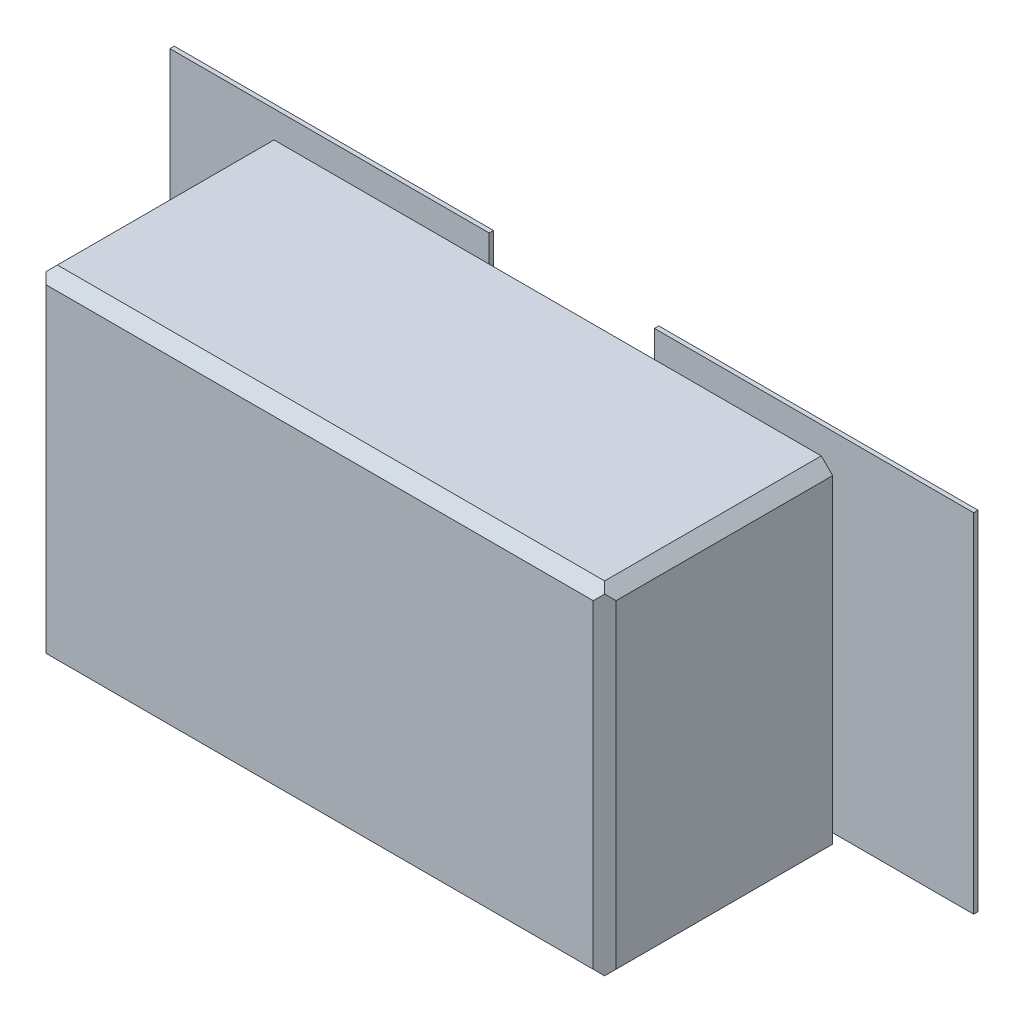
ISO-10303-21;
HEADER;
FILE_DESCRIPTION(('STEP AP214'),'2;1');
FILE_NAME('part.step','',(''),(''),'','','');
FILE_SCHEMA(('AUTOMOTIVE_DESIGN { 1 0 10303 214 1 1 1 1 }'));
ENDSEC;
DATA;
#1=APPLICATION_CONTEXT('core data for automotive mechanical design processes');
#2=APPLICATION_PROTOCOL_DEFINITION('international standard','automotive_design',2000,#1);
#3=PRODUCT_CONTEXT('',#1,'mechanical');
#4=PRODUCT('Part','Part','',(#3));
#5=PRODUCT_RELATED_PRODUCT_CATEGORY('part','',(#4));
#6=PRODUCT_DEFINITION_FORMATION('','',#4);
#7=PRODUCT_DEFINITION_CONTEXT('part definition',#1,'design');
#8=PRODUCT_DEFINITION('design','',#6,#7);
#9=PRODUCT_DEFINITION_SHAPE('','',#8);
#10=(LENGTH_UNIT() NAMED_UNIT(*) SI_UNIT(.MILLI.,.METRE.));
#11=(NAMED_UNIT(*) PLANE_ANGLE_UNIT() SI_UNIT($,.RADIAN.));
#12=(NAMED_UNIT(*) SI_UNIT($,.STERADIAN.) SOLID_ANGLE_UNIT());
#13=UNCERTAINTY_MEASURE_WITH_UNIT(LENGTH_MEASURE(1.E-05),#10,'distance_accuracy_value','');
#14=(GEOMETRIC_REPRESENTATION_CONTEXT(3) GLOBAL_UNCERTAINTY_ASSIGNED_CONTEXT((#13)) GLOBAL_UNIT_ASSIGNED_CONTEXT((#10,
#11,#12)) REPRESENTATION_CONTEXT('',''));
#15=CARTESIAN_POINT('',(0.,0.,0.));
#16=DIRECTION('',(0.,0.,1.));
#17=DIRECTION('',(1.,0.,0.));
#18=AXIS2_PLACEMENT_3D('',#15,#16,#17);
#19=CARTESIAN_POINT('',(-0.49,0.,0.5162));
#20=DIRECTION('',(-0.707106781186548,0.,0.707106781186548));
#21=DIRECTION('',(0.,1.,0.));
#22=AXIS2_PLACEMENT_3D('',#19,#20,#21);
#23=PLANE('',#22);
#24=DIRECTION('',(-0.577350269189626,0.577350269189626,-0.577350269189626));
#25=VECTOR('',#24,1.);
#26=CARTESIAN_POINT('',(-0.49,-0.29,0.5162));
#27=LINE('',#26,#25);
#28=CARTESIAN_POINT('',(-0.49,-0.29,0.5162));
#29=VERTEX_POINT('',#28);
#30=CARTESIAN_POINT('',(-0.5,-0.28,0.5062));
#31=VERTEX_POINT('',#30);
#32=EDGE_CURVE('P0_E207',#29,#31,#27,.T.);
#33=ORIENTED_EDGE('',*,*,#32,.F.);
#34=DIRECTION('',(-0.577350269189626,-0.577350269189626,-0.577350269189626));
#35=VECTOR('',#34,1.);
#36=CARTESIAN_POINT('',(-0.48,-0.28,0.5262));
#37=LINE('',#36,#35);
#38=CARTESIAN_POINT('',(-0.48,-0.28,0.5262));
#39=VERTEX_POINT('',#38);
#40=EDGE_CURVE('P0_E11',#39,#29,#37,.T.);
#41=ORIENTED_EDGE('',*,*,#40,.F.);
#42=DIRECTION('',(0.,-1.,0.));
#43=VECTOR('',#42,1.);
#44=CARTESIAN_POINT('',(-0.48,0.28,0.5262));
#45=LINE('',#44,#43);
#46=CARTESIAN_POINT('',(-0.48,0.28,0.5262));
#47=VERTEX_POINT('',#46);
#48=EDGE_CURVE('P0_E260',#47,#39,#45,.T.);
#49=ORIENTED_EDGE('',*,*,#48,.F.);
#50=DIRECTION('',(0.577350269189626,-0.577350269189626,0.577350269189626));
#51=VECTOR('',#50,1.);
#52=CARTESIAN_POINT('',(-0.49,0.29,0.5162));
#53=LINE('',#52,#51);
#54=CARTESIAN_POINT('',(-0.49,0.29,0.5162));
#55=VERTEX_POINT('',#54);
#56=EDGE_CURVE('P0_E261',#55,#47,#53,.T.);
#57=ORIENTED_EDGE('',*,*,#56,.F.);
#58=DIRECTION('',(0.577350269189626,0.577350269189626,0.577350269189626));
#59=VECTOR('',#58,1.);
#60=CARTESIAN_POINT('',(-0.5,0.28,0.5062));
#61=LINE('',#60,#59);
#62=CARTESIAN_POINT('',(-0.5,0.28,0.5062));
#63=VERTEX_POINT('',#62);
#64=EDGE_CURVE('P0_E210',#63,#55,#61,.T.);
#65=ORIENTED_EDGE('',*,*,#64,.F.);
#66=DIRECTION('',(0.,-1.,0.));
#67=VECTOR('',#66,1.);
#68=CARTESIAN_POINT('',(-0.5,0.28,0.5062));
#69=LINE('',#68,#67);
#70=EDGE_CURVE('P0_E204',#63,#31,#69,.T.);
#71=ORIENTED_EDGE('',*,*,#70,.T.);
#72=EDGE_LOOP('',(#33,#41,#49,#57,#65,#71));
#73=FACE_BOUND('',#72,.T.);
#74=ADVANCED_FACE('P0_F18',(#73),#23,.T.);
#75=CARTESIAN_POINT('',(0.,-0.29,0.5162));
#76=DIRECTION('',(0.,-0.707106781186548,0.707106781186548));
#77=DIRECTION('',(-1.,0.,0.));
#78=AXIS2_PLACEMENT_3D('',#75,#76,#77);
#79=PLANE('',#78);
#80=DIRECTION('',(-0.577350269189626,-0.577350269189626,-0.577350269189626));
#81=VECTOR('',#80,1.);
#82=CARTESIAN_POINT('',(0.49,-0.29,0.5162));
#83=LINE('',#82,#81);
#84=CARTESIAN_POINT('',(0.49,-0.29,0.5162));
#85=VERTEX_POINT('',#84);
#86=CARTESIAN_POINT('',(0.48,-0.3,0.5062));
#87=VERTEX_POINT('',#86);
#88=EDGE_CURVE('P0_E305',#85,#87,#83,.T.);
#89=ORIENTED_EDGE('',*,*,#88,.F.);
#90=DIRECTION('',(0.577350269189626,-0.577350269189626,-0.577350269189626));
#91=VECTOR('',#90,1.);
#92=CARTESIAN_POINT('',(0.48,-0.28,0.5262));
#93=LINE('',#92,#91);
#94=CARTESIAN_POINT('',(0.48,-0.28,0.5262));
#95=VERTEX_POINT('',#94);
#96=EDGE_CURVE('P0_E29',#95,#85,#93,.T.);
#97=ORIENTED_EDGE('',*,*,#96,.F.);
#98=DIRECTION('',(1.,0.,0.));
#99=VECTOR('',#98,1.);
#100=CARTESIAN_POINT('',(-0.48,-0.28,0.5262));
#101=LINE('',#100,#99);
#102=EDGE_CURVE('P0_E300',#39,#95,#101,.T.);
#103=ORIENTED_EDGE('',*,*,#102,.F.);
#104=ORIENTED_EDGE('',*,*,#40,.T.);
#105=DIRECTION('',(-0.577350269189626,0.577350269189626,0.577350269189626));
#106=VECTOR('',#105,1.);
#107=CARTESIAN_POINT('',(-0.48,-0.3,0.5062));
#108=LINE('',#107,#106);
#109=CARTESIAN_POINT('',(-0.48,-0.3,0.5062));
#110=VERTEX_POINT('',#109);
#111=EDGE_CURVE('P0_E227',#110,#29,#108,.T.);
#112=ORIENTED_EDGE('',*,*,#111,.F.);
#113=DIRECTION('',(1.,0.,0.));
#114=VECTOR('',#113,1.);
#115=CARTESIAN_POINT('',(-0.48,-0.3,0.5062));
#116=LINE('',#115,#114);
#117=EDGE_CURVE('P0_E315',#110,#87,#116,.T.);
#118=ORIENTED_EDGE('',*,*,#117,.T.);
#119=EDGE_LOOP('',(#89,#97,#103,#104,#112,#118));
#120=FACE_BOUND('',#119,.T.);
#121=ADVANCED_FACE('P0_F568',(#120),#79,.T.);
#122=CARTESIAN_POINT('',(0.49,0.,0.5162));
#123=DIRECTION('',(0.707106781186548,0.,0.707106781186548));
#124=DIRECTION('',(0.,-1.,0.));
#125=AXIS2_PLACEMENT_3D('',#122,#123,#124);
#126=PLANE('',#125);
#127=DIRECTION('',(0.577350269189626,-0.577350269189626,-0.577350269189626));
#128=VECTOR('',#127,1.);
#129=CARTESIAN_POINT('',(0.49,0.29,0.5162));
#130=LINE('',#129,#128);
#131=CARTESIAN_POINT('',(0.49,0.29,0.5162));
#132=VERTEX_POINT('',#131);
#133=CARTESIAN_POINT('',(0.5,0.28,0.5062));
#134=VERTEX_POINT('',#133);
#135=EDGE_CURVE('P0_E286',#132,#134,#130,.T.);
#136=ORIENTED_EDGE('',*,*,#135,.F.);
#137=DIRECTION('',(0.577350269189626,0.577350269189626,-0.577350269189626));
#138=VECTOR('',#137,1.);
#139=CARTESIAN_POINT('',(0.48,0.28,0.5262));
#140=LINE('',#139,#138);
#141=CARTESIAN_POINT('',(0.48,0.28,0.5262));
#142=VERTEX_POINT('',#141);
#143=EDGE_CURVE('P0_E281',#142,#132,#140,.T.);
#144=ORIENTED_EDGE('',*,*,#143,.F.);
#145=DIRECTION('',(0.,1.,0.));
#146=VECTOR('',#145,1.);
#147=CARTESIAN_POINT('',(0.48,-0.28,0.5262));
#148=LINE('',#147,#146);
#149=EDGE_CURVE('P0_E297',#95,#142,#148,.T.);
#150=ORIENTED_EDGE('',*,*,#149,.F.);
#151=ORIENTED_EDGE('',*,*,#96,.T.);
#152=DIRECTION('',(-0.577350269189626,-0.577350269189626,0.577350269189626));
#153=VECTOR('',#152,1.);
#154=CARTESIAN_POINT('',(0.5,-0.28,0.5062));
#155=LINE('',#154,#153);
#156=CARTESIAN_POINT('',(0.5,-0.28,0.5062));
#157=VERTEX_POINT('',#156);
#158=EDGE_CURVE('P0_E301',#157,#85,#155,.T.);
#159=ORIENTED_EDGE('',*,*,#158,.F.);
#160=DIRECTION('',(0.,1.,0.));
#161=VECTOR('',#160,1.);
#162=CARTESIAN_POINT('',(0.5,-0.28,0.5062));
#163=LINE('',#162,#161);
#164=EDGE_CURVE('P0_E355',#157,#134,#163,.T.);
#165=ORIENTED_EDGE('',*,*,#164,.T.);
#166=EDGE_LOOP('',(#136,#144,#150,#151,#159,#165));
#167=FACE_BOUND('',#166,.T.);
#168=ADVANCED_FACE('P0_F574',(#167),#126,.T.);
#169=CARTESIAN_POINT('',(0.,0.,0.5262));
#170=DIRECTION('',(0.,0.,1.));
#171=DIRECTION('',(1.,0.,0.));
#172=AXIS2_PLACEMENT_3D('',#169,#170,#171);
#173=PLANE('',#172);
#174=DIRECTION('',(-1.,0.,0.));
#175=VECTOR('',#174,1.);
#176=CARTESIAN_POINT('',(0.48,0.28,0.5262));
#177=LINE('',#176,#175);
#178=EDGE_CURVE('P0_E256',#142,#47,#177,.T.);
#179=ORIENTED_EDGE('',*,*,#178,.T.);
#180=ORIENTED_EDGE('',*,*,#48,.T.);
#181=ORIENTED_EDGE('',*,*,#102,.T.);
#182=ORIENTED_EDGE('',*,*,#149,.T.);
#183=EDGE_LOOP('',(#179,#180,#181,#182));
#184=FACE_BOUND('',#183,.T.);
#185=ADVANCED_FACE('P0_F584',(#184),#173,.T.);
#186=CARTESIAN_POINT('',(0.,0.29,0.5162));
#187=DIRECTION('',(0.,0.707106781186548,0.707106781186548));
#188=DIRECTION('',(1.,0.,0.));
#189=AXIS2_PLACEMENT_3D('',#186,#187,#188);
#190=PLANE('',#189);
#191=ORIENTED_EDGE('',*,*,#143,.T.);
#192=DIRECTION('',(0.577350269189626,-0.577350269189626,0.577350269189626));
#193=VECTOR('',#192,1.);
#194=CARTESIAN_POINT('',(0.48,0.3,0.5062));
#195=LINE('',#194,#193);
#196=CARTESIAN_POINT('',(0.48,0.3,0.5062));
#197=VERTEX_POINT('',#196);
#198=EDGE_CURVE('P0_E254',#197,#132,#195,.T.);
#199=ORIENTED_EDGE('',*,*,#198,.F.);
#200=DIRECTION('',(-1.,0.,0.));
#201=VECTOR('',#200,1.);
#202=CARTESIAN_POINT('',(0.48,0.3,0.5062));
#203=LINE('',#202,#201);
#204=CARTESIAN_POINT('',(-0.48,0.3,0.5062));
#205=VERTEX_POINT('',#204);
#206=EDGE_CURVE('P0_E278',#197,#205,#203,.T.);
#207=ORIENTED_EDGE('',*,*,#206,.T.);
#208=DIRECTION('',(-0.577350269189626,-0.577350269189626,0.577350269189626));
#209=VECTOR('',#208,1.);
#210=CARTESIAN_POINT('',(-0.48,0.3,0.5062));
#211=LINE('',#210,#209);
#212=EDGE_CURVE('P0_E372',#205,#55,#211,.T.);
#213=ORIENTED_EDGE('',*,*,#212,.T.);
#214=ORIENTED_EDGE('',*,*,#56,.T.);
#215=ORIENTED_EDGE('',*,*,#178,.F.);
#216=EDGE_LOOP('',(#191,#199,#207,#213,#214,#215));
#217=FACE_BOUND('',#216,.T.);
#218=ADVANCED_FACE('P0_F580',(#217),#190,.T.);
#219=CARTESIAN_POINT('',(0.5,0.3,0.0762));
#220=DIRECTION('',(0.,1.,0.));
#221=DIRECTION('',(1.,0.,0.));
#222=AXIS2_PLACEMENT_3D('',#219,#220,#221);
#223=PLANE('',#222);
#224=DIRECTION('',(-1.,0.,0.));
#225=VECTOR('',#224,1.);
#226=CARTESIAN_POINT('',(0.48,0.3,0.1262));
#227=LINE('',#226,#225);
#228=CARTESIAN_POINT('',(0.48,0.3,0.1262));
#229=VERTEX_POINT('',#228);
#230=CARTESIAN_POINT('',(-0.48,0.3,0.1262));
#231=VERTEX_POINT('',#230);
#232=EDGE_CURVE('P0_E330',#229,#231,#227,.T.);
#233=ORIENTED_EDGE('',*,*,#232,.T.);
#234=DIRECTION('',(0.,0.,-1.));
#235=VECTOR('',#234,1.);
#236=CARTESIAN_POINT('',(-0.48,0.3,0.5062));
#237=LINE('',#236,#235);
#238=EDGE_CURVE('P0_E282',#205,#231,#237,.T.);
#239=ORIENTED_EDGE('',*,*,#238,.F.);
#240=ORIENTED_EDGE('',*,*,#206,.F.);
#241=DIRECTION('',(0.,0.,-1.));
#242=VECTOR('',#241,1.);
#243=CARTESIAN_POINT('',(0.48,0.3,0.5062));
#244=LINE('',#243,#242);
#245=EDGE_CURVE('P0_E251',#197,#229,#244,.T.);
#246=ORIENTED_EDGE('',*,*,#245,.T.);
#247=EDGE_LOOP('',(#233,#239,#240,#246));
#248=FACE_BOUND('',#247,.T.);
#249=ADVANCED_FACE('P0_F583',(#248),#223,.T.);
#250=CARTESIAN_POINT('',(-0.49,0.29,0.3262));
#251=DIRECTION('',(-0.707106781186548,0.707106781186548,0.));
#252=DIRECTION('',(0.,0.,1.));
#253=AXIS2_PLACEMENT_3D('',#250,#251,#252);
#254=PLANE('',#253);
#255=DIRECTION('',(0.,0.,-1.));
#256=VECTOR('',#255,1.);
#257=CARTESIAN_POINT('',(-0.5,0.28,0.5062));
#258=LINE('',#257,#256);
#259=CARTESIAN_POINT('',(-0.5,0.28,0.1262));
#260=VERTEX_POINT('',#259);
#261=EDGE_CURVE('P0_E214',#63,#260,#258,.T.);
#262=ORIENTED_EDGE('',*,*,#261,.F.);
#263=ORIENTED_EDGE('',*,*,#64,.T.);
#264=ORIENTED_EDGE('',*,*,#212,.F.);
#265=ORIENTED_EDGE('',*,*,#238,.T.);
#266=DIRECTION('',(0.707106781186548,0.707106781186548,0.));
#267=VECTOR('',#266,1.);
#268=CARTESIAN_POINT('',(-0.5,0.28,0.1262));
#269=LINE('',#268,#267);
#270=EDGE_CURVE('P0_E340',#260,#231,#269,.T.);
#271=ORIENTED_EDGE('',*,*,#270,.F.);
#272=EDGE_LOOP('',(#262,#263,#264,#265,#271));
#273=FACE_BOUND('',#272,.T.);
#274=ADVANCED_FACE('P0_F588',(#273),#254,.T.);
#275=CARTESIAN_POINT('',(-0.5,0.3,0.0762));
#276=DIRECTION('',(-1.,0.,0.));
#277=DIRECTION('',(0.,0.,1.));
#278=AXIS2_PLACEMENT_3D('',#275,#276,#277);
#279=PLANE('',#278);
#280=ORIENTED_EDGE('',*,*,#70,.F.);
#281=ORIENTED_EDGE('',*,*,#261,.T.);
#282=DIRECTION('',(0.,-1.,0.));
#283=VECTOR('',#282,1.);
#284=CARTESIAN_POINT('',(-0.5,0.28,0.1262));
#285=LINE('',#284,#283);
#286=CARTESIAN_POINT('',(-0.5,-0.28,0.1262));
#287=VERTEX_POINT('',#286);
#288=EDGE_CURVE('P0_E219',#260,#287,#285,.T.);
#289=ORIENTED_EDGE('',*,*,#288,.T.);
#290=DIRECTION('',(0.,0.,-1.));
#291=VECTOR('',#290,1.);
#292=CARTESIAN_POINT('',(-0.5,-0.28,0.5062));
#293=LINE('',#292,#291);
#294=EDGE_CURVE('P0_E215',#31,#287,#293,.T.);
#295=ORIENTED_EDGE('',*,*,#294,.F.);
#296=EDGE_LOOP('',(#280,#281,#289,#295));
#297=FACE_BOUND('',#296,.T.);
#298=ADVANCED_FACE('P0_F217',(#297),#279,.T.);
#299=CARTESIAN_POINT('',(-0.49,-0.29,0.3262));
#300=DIRECTION('',(-0.707106781186548,-0.707106781186548,0.));
#301=DIRECTION('',(-0.707106781186548,0.707106781186548,0.));
#302=AXIS2_PLACEMENT_3D('',#299,#300,#301);
#303=PLANE('',#302);
#304=DIRECTION('',(0.,0.,-1.));
#305=VECTOR('',#304,1.);
#306=CARTESIAN_POINT('',(-0.48,-0.3,0.5062));
#307=LINE('',#306,#305);
#308=CARTESIAN_POINT('',(-0.48,-0.3,0.1262));
#309=VERTEX_POINT('',#308);
#310=EDGE_CURVE('P0_E236',#110,#309,#307,.T.);
#311=ORIENTED_EDGE('',*,*,#310,.F.);
#312=ORIENTED_EDGE('',*,*,#111,.T.);
#313=ORIENTED_EDGE('',*,*,#32,.T.);
#314=ORIENTED_EDGE('',*,*,#294,.T.);
#315=DIRECTION('',(-0.707106781186548,0.707106781186548,0.));
#316=VECTOR('',#315,1.);
#317=CARTESIAN_POINT('',(-0.48,-0.3,0.1262));
#318=LINE('',#317,#316);
#319=EDGE_CURVE('P0_E287',#309,#287,#318,.T.);
#320=ORIENTED_EDGE('',*,*,#319,.F.);
#321=EDGE_LOOP('',(#311,#312,#313,#314,#320));
#322=FACE_BOUND('',#321,.T.);
#323=ADVANCED_FACE('P0_F226',(#322),#303,.T.);
#324=CARTESIAN_POINT('',(-0.5,-0.3,0.0762));
#325=DIRECTION('',(0.,-1.,0.));
#326=DIRECTION('',(0.,0.,-1.));
#327=AXIS2_PLACEMENT_3D('',#324,#325,#326);
#328=PLANE('',#327);
#329=ORIENTED_EDGE('',*,*,#117,.F.);
#330=ORIENTED_EDGE('',*,*,#310,.T.);
#331=DIRECTION('',(1.,0.,0.));
#332=VECTOR('',#331,1.);
#333=CARTESIAN_POINT('',(-0.48,-0.3,0.1262));
#334=LINE('',#333,#332);
#335=CARTESIAN_POINT('',(0.48,-0.3,0.1262));
#336=VERTEX_POINT('',#335);
#337=EDGE_CURVE('P0_E290',#309,#336,#334,.T.);
#338=ORIENTED_EDGE('',*,*,#337,.T.);
#339=DIRECTION('',(0.,0.,-1.));
#340=VECTOR('',#339,1.);
#341=CARTESIAN_POINT('',(0.48,-0.3,0.5062));
#342=LINE('',#341,#340);
#343=EDGE_CURVE('P0_E312',#87,#336,#342,.T.);
#344=ORIENTED_EDGE('',*,*,#343,.F.);
#345=EDGE_LOOP('',(#329,#330,#338,#344));
#346=FACE_BOUND('',#345,.T.);
#347=ADVANCED_FACE('P0_F589',(#346),#328,.T.);
#348=CARTESIAN_POINT('',(0.49,-0.29,0.3262));
#349=DIRECTION('',(0.707106781186548,-0.707106781186548,0.));
#350=DIRECTION('',(0.,0.,-1.));
#351=AXIS2_PLACEMENT_3D('',#348,#349,#350);
#352=PLANE('',#351);
#353=DIRECTION('',(0.,0.,-1.));
#354=VECTOR('',#353,1.);
#355=CARTESIAN_POINT('',(0.5,-0.28,0.5062));
#356=LINE('',#355,#354);
#357=CARTESIAN_POINT('',(0.5,-0.28,0.1262));
#358=VERTEX_POINT('',#357);
#359=EDGE_CURVE('P0_E306',#157,#358,#356,.T.);
#360=ORIENTED_EDGE('',*,*,#359,.F.);
#361=ORIENTED_EDGE('',*,*,#158,.T.);
#362=ORIENTED_EDGE('',*,*,#88,.T.);
#363=ORIENTED_EDGE('',*,*,#343,.T.);
#364=DIRECTION('',(-0.707106781186548,-0.707106781186548,0.));
#365=VECTOR('',#364,1.);
#366=CARTESIAN_POINT('',(0.5,-0.28,0.1262));
#367=LINE('',#366,#365);
#368=EDGE_CURVE('P0_E363',#358,#336,#367,.T.);
#369=ORIENTED_EDGE('',*,*,#368,.F.);
#370=EDGE_LOOP('',(#360,#361,#362,#363,#369));
#371=FACE_BOUND('',#370,.T.);
#372=ADVANCED_FACE('P0_F578',(#371),#352,.T.);
#373=CARTESIAN_POINT('',(0.5,-0.3,0.0762));
#374=DIRECTION('',(1.,0.,0.));
#375=DIRECTION('',(0.,1.,0.));
#376=AXIS2_PLACEMENT_3D('',#373,#374,#375);
#377=PLANE('',#376);
#378=ORIENTED_EDGE('',*,*,#164,.F.);
#379=ORIENTED_EDGE('',*,*,#359,.T.);
#380=DIRECTION('',(0.,1.,0.));
#381=VECTOR('',#380,1.);
#382=CARTESIAN_POINT('',(0.5,-0.28,0.1262));
#383=LINE('',#382,#381);
#384=CARTESIAN_POINT('',(0.5,0.28,0.1262));
#385=VERTEX_POINT('',#384);
#386=EDGE_CURVE('P0_E380',#358,#385,#383,.T.);
#387=ORIENTED_EDGE('',*,*,#386,.T.);
#388=DIRECTION('',(0.,0.,-1.));
#389=VECTOR('',#388,1.);
#390=CARTESIAN_POINT('',(0.5,0.28,0.5062));
#391=LINE('',#390,#389);
#392=EDGE_CURVE('P0_E368',#134,#385,#391,.T.);
#393=ORIENTED_EDGE('',*,*,#392,.F.);
#394=EDGE_LOOP('',(#378,#379,#387,#393));
#395=FACE_BOUND('',#394,.T.);
#396=ADVANCED_FACE('P0_F626',(#395),#377,.T.);
#397=CARTESIAN_POINT('',(0.49,0.29,0.3262));
#398=DIRECTION('',(0.707106781186548,0.707106781186548,0.));
#399=DIRECTION('',(0.,0.,-1.));
#400=AXIS2_PLACEMENT_3D('',#397,#398,#399);
#401=PLANE('',#400);
#402=ORIENTED_EDGE('',*,*,#245,.F.);
#403=ORIENTED_EDGE('',*,*,#198,.T.);
#404=ORIENTED_EDGE('',*,*,#135,.T.);
#405=ORIENTED_EDGE('',*,*,#392,.T.);
#406=DIRECTION('',(0.707106781186548,-0.707106781186548,0.));
#407=VECTOR('',#406,1.);
#408=CARTESIAN_POINT('',(0.48,0.3,0.1262));
#409=LINE('',#408,#407);
#410=EDGE_CURVE('P0_E267',#229,#385,#409,.T.);
#411=ORIENTED_EDGE('',*,*,#410,.F.);
#412=EDGE_LOOP('',(#402,#403,#404,#405,#411));
#413=FACE_BOUND('',#412,.T.);
#414=ADVANCED_FACE('P0_F610',(#413),#401,.T.);
#415=CARTESIAN_POINT('',(-0.4659973957868,-0.25,0.1262));
#416=DIRECTION('',(-1.,0.,0.));
#417=DIRECTION('',(0.,0.,1.));
#418=AXIS2_PLACEMENT_3D('',#415,#416,#417);
#419=PLANE('',#418);
#420=DIRECTION('',(0.,0.,-1.));
#421=VECTOR('',#420,1.);
#422=CARTESIAN_POINT('',(-0.4659973957868,0.2,0.1262));
#423=LINE('',#422,#421);
#424=CARTESIAN_POINT('',(-0.4659973957868,0.2,0.1262));
#425=VERTEX_POINT('',#424);
#426=CARTESIAN_POINT('',(-0.4659973957868,0.2,0.0862));
#427=VERTEX_POINT('',#426);
#428=EDGE_CURVE('P0_E255',#425,#427,#423,.T.);
#429=ORIENTED_EDGE('',*,*,#428,.T.);
#430=DIRECTION('',(0.,1.,0.));
#431=VECTOR('',#430,1.);
#432=CARTESIAN_POINT('',(-0.4659973957868,-0.25,0.0862));
#433=LINE('',#432,#431);
#434=CARTESIAN_POINT('',(-0.4659973957868,-0.25,0.0862));
#435=VERTEX_POINT('',#434);
#436=EDGE_CURVE('P0_E399',#435,#427,#433,.T.);
#437=ORIENTED_EDGE('',*,*,#436,.F.);
#438=DIRECTION('',(0.,0.,-1.));
#439=VECTOR('',#438,1.);
#440=CARTESIAN_POINT('',(-0.4659973957868,-0.25,0.1262));
#441=LINE('',#440,#439);
#442=CARTESIAN_POINT('',(-0.4659973957868,-0.25,0.1262));
#443=VERTEX_POINT('',#442);
#444=EDGE_CURVE('P0_E307',#443,#435,#441,.T.);
#445=ORIENTED_EDGE('',*,*,#444,.F.);
#446=DIRECTION('',(0.,1.,0.));
#447=VECTOR('',#446,1.);
#448=CARTESIAN_POINT('',(-0.4659973957868,-0.25,0.1262));
#449=LINE('',#448,#447);
#450=EDGE_CURVE('P0_E22',#443,#425,#449,.T.);
#451=ORIENTED_EDGE('',*,*,#450,.T.);
#452=EDGE_LOOP('',(#429,#437,#445,#451));
#453=FACE_BOUND('',#452,.T.);
#454=ADVANCED_FACE('P0_F486',(#453),#419,.T.);
#455=CARTESIAN_POINT('',(-0.4659973957868,0.25,0.1262));
#456=DIRECTION('',(0.,0.,-1.));
#457=DIRECTION('',(-1.,0.,0.));
#458=AXIS2_PLACEMENT_3D('',#455,#456,#457);
#459=CYLINDRICAL_SURFACE('',#458,0.05);
#460=DIRECTION('',(0.,0.,-1.));
#461=VECTOR('',#460,1.);
#462=CARTESIAN_POINT('',(-0.4159973957868,0.25,0.1262));
#463=LINE('',#462,#461);
#464=CARTESIAN_POINT('',(-0.4159973957868,0.25,0.1262));
#465=VERTEX_POINT('',#464);
#466=CARTESIAN_POINT('',(-0.4159973957868,0.25,0.0862));
#467=VERTEX_POINT('',#466);
#468=EDGE_CURVE('P0_E249',#465,#467,#463,.T.);
#469=ORIENTED_EDGE('',*,*,#468,.T.);
#470=CARTESIAN_POINT('',(-0.4659973957868,0.25,0.0862));
#471=DIRECTION('',(0.,0.,1.));
#472=DIRECTION('',(0.,-1.,0.));
#473=AXIS2_PLACEMENT_3D('',#470,#471,#472);
#474=CIRCLE('',#473,0.05);
#475=EDGE_CURVE('P0_E277',#427,#467,#474,.T.);
#476=ORIENTED_EDGE('',*,*,#475,.F.);
#477=ORIENTED_EDGE('',*,*,#428,.F.);
#478=CARTESIAN_POINT('',(-0.4659973957868,0.25,0.1262));
#479=DIRECTION('',(0.,0.,-1.));
#480=DIRECTION('',(1.,0.,0.));
#481=AXIS2_PLACEMENT_3D('',#478,#479,#480);
#482=CIRCLE('',#481,0.05);
#483=EDGE_CURVE('P0_E266',#465,#425,#482,.T.);
#484=ORIENTED_EDGE('',*,*,#483,.F.);
#485=EDGE_LOOP('',(#469,#476,#477,#484));
#486=FACE_BOUND('',#485,.T.);
#487=ADVANCED_FACE('P0_F475',(#486),#459,.F.);
#488=CARTESIAN_POINT('',(-0.4159973957868,0.25,0.1262));
#489=DIRECTION('',(0.,1.,0.));
#490=DIRECTION('',(1.,0.,0.));
#491=AXIS2_PLACEMENT_3D('',#488,#489,#490);
#492=PLANE('',#491);
#493=DIRECTION('',(0.,0.,-1.));
#494=VECTOR('',#493,1.);
#495=CARTESIAN_POINT('',(-0.2159973957868,0.25,0.1262));
#496=LINE('',#495,#494);
#497=CARTESIAN_POINT('',(-0.2159973957868,0.25,0.1262));
#498=VERTEX_POINT('',#497);
#499=CARTESIAN_POINT('',(-0.2159973957868,0.25,0.0862));
#500=VERTEX_POINT('',#499);
#501=EDGE_CURVE('P0_E246',#498,#500,#496,.T.);
#502=ORIENTED_EDGE('',*,*,#501,.T.);
#503=DIRECTION('',(1.,0.,0.));
#504=VECTOR('',#503,1.);
#505=CARTESIAN_POINT('',(-0.4159973957868,0.25,0.0862));
#506=LINE('',#505,#504);
#507=EDGE_CURVE('P0_E273',#467,#500,#506,.T.);
#508=ORIENTED_EDGE('',*,*,#507,.F.);
#509=ORIENTED_EDGE('',*,*,#468,.F.);
#510=DIRECTION('',(1.,0.,0.));
#511=VECTOR('',#510,1.);
#512=CARTESIAN_POINT('',(-0.4159973957868,0.25,0.1262));
#513=LINE('',#512,#511);
#514=EDGE_CURVE('P0_E262',#465,#498,#513,.T.);
#515=ORIENTED_EDGE('',*,*,#514,.T.);
#516=EDGE_LOOP('',(#502,#508,#509,#515));
#517=FACE_BOUND('',#516,.T.);
#518=ADVANCED_FACE('P0_F478',(#517),#492,.T.);
#519=CARTESIAN_POINT('',(-0.2159973957868,0.25,0.1262));
#520=DIRECTION('',(1.,0.,0.));
#521=DIRECTION('',(0.,1.,0.));
#522=AXIS2_PLACEMENT_3D('',#519,#520,#521);
#523=PLANE('',#522);
#524=DIRECTION('',(0.,0.,-1.));
#525=VECTOR('',#524,1.);
#526=CARTESIAN_POINT('',(-0.2159973957868,-0.25,0.1262));
#527=LINE('',#526,#525);
#528=CARTESIAN_POINT('',(-0.2159973957868,-0.25,0.1262));
#529=VERTEX_POINT('',#528);
#530=CARTESIAN_POINT('',(-0.2159973957868,-0.25,0.0862));
#531=VERTEX_POINT('',#530);
#532=EDGE_CURVE('P0_E381',#529,#531,#527,.T.);
#533=ORIENTED_EDGE('',*,*,#532,.T.);
#534=DIRECTION('',(0.,-1.,0.));
#535=VECTOR('',#534,1.);
#536=CARTESIAN_POINT('',(-0.2159973957868,0.25,0.0862));
#537=LINE('',#536,#535);
#538=EDGE_CURVE('P0_E250',#500,#531,#537,.T.);
#539=ORIENTED_EDGE('',*,*,#538,.F.);
#540=ORIENTED_EDGE('',*,*,#501,.F.);
#541=DIRECTION('',(0.,-1.,0.));
#542=VECTOR('',#541,1.);
#543=CARTESIAN_POINT('',(-0.2159973957868,0.25,0.1262));
#544=LINE('',#543,#542);
#545=EDGE_CURVE('P0_E323',#498,#529,#544,.T.);
#546=ORIENTED_EDGE('',*,*,#545,.T.);
#547=EDGE_LOOP('',(#533,#539,#540,#546));
#548=FACE_BOUND('',#547,.T.);
#549=ADVANCED_FACE('P0_F558',(#548),#523,.T.);
#550=CARTESIAN_POINT('',(0.,0.,0.0862));
#551=DIRECTION('',(0.,0.,-1.));
#552=DIRECTION('',(0.,-1.,0.));
#553=AXIS2_PLACEMENT_3D('',#550,#551,#552);
#554=PLANE('',#553);
#555=DIRECTION('',(-1.,0.,0.));
#556=VECTOR('',#555,1.);
#557=CARTESIAN_POINT('',(-0.2159973957868,-0.25,0.0862));
#558=LINE('',#557,#556);
#559=EDGE_CURVE('P0_E311',#531,#435,#558,.T.);
#560=ORIENTED_EDGE('',*,*,#559,.T.);
#561=ORIENTED_EDGE('',*,*,#436,.T.);
#562=ORIENTED_EDGE('',*,*,#475,.T.);
#563=ORIENTED_EDGE('',*,*,#507,.T.);
#564=ORIENTED_EDGE('',*,*,#538,.T.);
#565=EDGE_LOOP('',(#560,#561,#562,#563,#564));
#566=FACE_BOUND('',#565,.T.);
#567=ADVANCED_FACE('P0_F481',(#566),#554,.T.);
#568=CARTESIAN_POINT('',(0.,0.,0.0862));
#569=DIRECTION('',(0.,0.,-1.));
#570=DIRECTION('',(0.,-1.,0.));
#571=AXIS2_PLACEMENT_3D('',#568,#569,#570);
#572=PLANE('',#571);
#573=DIRECTION('',(-1.,0.,0.));
#574=VECTOR('',#573,1.);
#575=CARTESIAN_POINT('',(0.4340026042132,-0.25,0.0862));
#576=LINE('',#575,#574);
#577=CARTESIAN_POINT('',(0.4340026042132,-0.25,0.0862));
#578=VERTEX_POINT('',#577);
#579=CARTESIAN_POINT('',(0.1840026042132,-0.25,0.0862));
#580=VERTEX_POINT('',#579);
#581=EDGE_CURVE('P0_E396',#578,#580,#576,.T.);
#582=ORIENTED_EDGE('',*,*,#581,.T.);
#583=DIRECTION('',(0.,1.,0.));
#584=VECTOR('',#583,1.);
#585=CARTESIAN_POINT('',(0.1840026042132,-0.25,0.0862));
#586=LINE('',#585,#584);
#587=CARTESIAN_POINT('',(0.1840026042132,0.25,0.0862));
#588=VERTEX_POINT('',#587);
#589=EDGE_CURVE('P0_E322',#580,#588,#586,.T.);
#590=ORIENTED_EDGE('',*,*,#589,.T.);
#591=DIRECTION('',(1.,0.,0.));
#592=VECTOR('',#591,1.);
#593=CARTESIAN_POINT('',(0.1840026042132,0.25,0.0862));
#594=LINE('',#593,#592);
#595=CARTESIAN_POINT('',(0.4340026042132,0.25,0.0862));
#596=VERTEX_POINT('',#595);
#597=EDGE_CURVE('P0_E272',#588,#596,#594,.T.);
#598=ORIENTED_EDGE('',*,*,#597,.T.);
#599=DIRECTION('',(0.,-1.,0.));
#600=VECTOR('',#599,1.);
#601=CARTESIAN_POINT('',(0.4340026042132,0.25,0.0862));
#602=LINE('',#601,#600);
#603=EDGE_CURVE('P0_E240',#596,#578,#602,.T.);
#604=ORIENTED_EDGE('',*,*,#603,.T.);
#605=EDGE_LOOP('',(#582,#590,#598,#604));
#606=FACE_BOUND('',#605,.T.);
#607=ADVANCED_FACE('P0_F455',(#606),#572,.T.);
#608=CARTESIAN_POINT('',(0.4340026042132,-0.25,0.1262));
#609=DIRECTION('',(0.,-1.,0.));
#610=DIRECTION('',(0.,0.,-1.));
#611=AXIS2_PLACEMENT_3D('',#608,#609,#610);
#612=PLANE('',#611);
#613=DIRECTION('',(0.,0.,-1.));
#614=VECTOR('',#613,1.);
#615=CARTESIAN_POINT('',(0.1840026042132,-0.25,0.1262));
#616=LINE('',#615,#614);
#617=CARTESIAN_POINT('',(0.1840026042132,-0.25,0.1262));
#618=VERTEX_POINT('',#617);
#619=EDGE_CURVE('P0_E400',#618,#580,#616,.T.);
#620=ORIENTED_EDGE('',*,*,#619,.T.);
#621=ORIENTED_EDGE('',*,*,#581,.F.);
#622=DIRECTION('',(0.,0.,-1.));
#623=VECTOR('',#622,1.);
#624=CARTESIAN_POINT('',(0.4340026042132,-0.25,0.1262));
#625=LINE('',#624,#623);
#626=CARTESIAN_POINT('',(0.4340026042132,-0.25,0.1262));
#627=VERTEX_POINT('',#626);
#628=EDGE_CURVE('P0_E242',#627,#578,#625,.T.);
#629=ORIENTED_EDGE('',*,*,#628,.F.);
#630=DIRECTION('',(-1.,0.,0.));
#631=VECTOR('',#630,1.);
#632=CARTESIAN_POINT('',(0.4340026042132,-0.25,0.1262));
#633=LINE('',#632,#631);
#634=EDGE_CURVE('P0_E295',#627,#618,#633,.T.);
#635=ORIENTED_EDGE('',*,*,#634,.T.);
#636=EDGE_LOOP('',(#620,#621,#629,#635));
#637=FACE_BOUND('',#636,.T.);
#638=ADVANCED_FACE('P0_F443',(#637),#612,.T.);
#639=CARTESIAN_POINT('',(0.1840026042132,-0.25,0.1262));
#640=DIRECTION('',(-1.,0.,0.));
#641=DIRECTION('',(0.,0.,1.));
#642=AXIS2_PLACEMENT_3D('',#639,#640,#641);
#643=PLANE('',#642);
#644=DIRECTION('',(0.,0.,-1.));
#645=VECTOR('',#644,1.);
#646=CARTESIAN_POINT('',(0.1840026042132,0.25,0.1262));
#647=LINE('',#646,#645);
#648=CARTESIAN_POINT('',(0.1840026042132,0.25,0.1262));
#649=VERTEX_POINT('',#648);
#650=EDGE_CURVE('P0_E318',#649,#588,#647,.T.);
#651=ORIENTED_EDGE('',*,*,#650,.T.);
#652=ORIENTED_EDGE('',*,*,#589,.F.);
#653=ORIENTED_EDGE('',*,*,#619,.F.);
#654=DIRECTION('',(0.,1.,0.));
#655=VECTOR('',#654,1.);
#656=CARTESIAN_POINT('',(0.1840026042132,-0.25,0.1262));
#657=LINE('',#656,#655);
#658=EDGE_CURVE('P0_E291',#618,#649,#657,.T.);
#659=ORIENTED_EDGE('',*,*,#658,.T.);
#660=EDGE_LOOP('',(#651,#652,#653,#659));
#661=FACE_BOUND('',#660,.T.);
#662=ADVANCED_FACE('P0_F452',(#661),#643,.T.);
#663=CARTESIAN_POINT('',(0.1840026042132,0.25,0.1262));
#664=DIRECTION('',(0.,1.,0.));
#665=DIRECTION('',(1.,0.,0.));
#666=AXIS2_PLACEMENT_3D('',#663,#664,#665);
#667=PLANE('',#666);
#668=DIRECTION('',(0.,0.,-1.));
#669=VECTOR('',#668,1.);
#670=CARTESIAN_POINT('',(0.4340026042132,0.25,0.1262));
#671=LINE('',#670,#669);
#672=CARTESIAN_POINT('',(0.4340026042132,0.25,0.1262));
#673=VERTEX_POINT('',#672);
#674=EDGE_CURVE('P0_E268',#673,#596,#671,.T.);
#675=ORIENTED_EDGE('',*,*,#674,.T.);
#676=ORIENTED_EDGE('',*,*,#597,.F.);
#677=ORIENTED_EDGE('',*,*,#650,.F.);
#678=DIRECTION('',(1.,0.,0.));
#679=VECTOR('',#678,1.);
#680=CARTESIAN_POINT('',(0.1840026042132,0.25,0.1262));
#681=LINE('',#680,#679);
#682=EDGE_CURVE('P0_E296',#649,#673,#681,.T.);
#683=ORIENTED_EDGE('',*,*,#682,.T.);
#684=EDGE_LOOP('',(#675,#676,#677,#683));
#685=FACE_BOUND('',#684,.T.);
#686=ADVANCED_FACE('P0_F461',(#685),#667,.T.);
#687=CARTESIAN_POINT('',(0.4340026042132,0.25,0.1262));
#688=DIRECTION('',(1.,0.,0.));
#689=DIRECTION('',(0.,1.,0.));
#690=AXIS2_PLACEMENT_3D('',#687,#688,#689);
#691=PLANE('',#690);
#692=ORIENTED_EDGE('',*,*,#628,.T.);
#693=ORIENTED_EDGE('',*,*,#603,.F.);
#694=ORIENTED_EDGE('',*,*,#674,.F.);
#695=DIRECTION('',(0.,-1.,0.));
#696=VECTOR('',#695,1.);
#697=CARTESIAN_POINT('',(0.4340026042132,0.25,0.1262));
#698=LINE('',#697,#696);
#699=EDGE_CURVE('P0_E245',#673,#627,#698,.T.);
#700=ORIENTED_EDGE('',*,*,#699,.T.);
#701=EDGE_LOOP('',(#692,#693,#694,#700));
#702=FACE_BOUND('',#701,.T.);
#703=ADVANCED_FACE('P0_F459',(#702),#691,.T.);
#704=CARTESIAN_POINT('',(0.,0.,0.1262));
#705=DIRECTION('',(0.,0.,1.));
#706=DIRECTION('',(1.,0.,0.));
#707=AXIS2_PLACEMENT_3D('',#704,#705,#706);
#708=PLANE('',#707);
#709=ORIENTED_EDGE('',*,*,#682,.F.);
#710=ORIENTED_EDGE('',*,*,#658,.F.);
#711=ORIENTED_EDGE('',*,*,#634,.F.);
#712=ORIENTED_EDGE('',*,*,#699,.F.);
#713=EDGE_LOOP('',(#709,#710,#711,#712));
#714=FACE_BOUND('',#713,.T.);
#715=ORIENTED_EDGE('',*,*,#514,.F.);
#716=ORIENTED_EDGE('',*,*,#483,.T.);
#717=ORIENTED_EDGE('',*,*,#450,.F.);
#718=DIRECTION('',(-1.,0.,0.));
#719=VECTOR('',#718,1.);
#720=CARTESIAN_POINT('',(-0.2159973957868,-0.25,0.1262));
#721=LINE('',#720,#719);
#722=EDGE_CURVE('P0_E376',#529,#443,#721,.T.);
#723=ORIENTED_EDGE('',*,*,#722,.F.);
#724=ORIENTED_EDGE('',*,*,#545,.F.);
#725=EDGE_LOOP('',(#715,#716,#717,#723,#724));
#726=FACE_BOUND('',#725,.T.);
#727=ORIENTED_EDGE('',*,*,#386,.F.);
#728=ORIENTED_EDGE('',*,*,#368,.T.);
#729=ORIENTED_EDGE('',*,*,#337,.F.);
#730=ORIENTED_EDGE('',*,*,#319,.T.);
#731=ORIENTED_EDGE('',*,*,#288,.F.);
#732=ORIENTED_EDGE('',*,*,#270,.T.);
#733=ORIENTED_EDGE('',*,*,#232,.F.);
#734=ORIENTED_EDGE('',*,*,#410,.T.);
#735=EDGE_LOOP('',(#727,#728,#729,#730,#731,#732,#733,#734));
#736=FACE_BOUND('',#735,.T.);
#737=ADVANCED_FACE('P0_F448',(#714,#726,#736),#708,.F.);
#738=CARTESIAN_POINT('',(-0.2159973957868,-0.25,0.1262));
#739=DIRECTION('',(0.,-1.,0.));
#740=DIRECTION('',(0.,0.,-1.));
#741=AXIS2_PLACEMENT_3D('',#738,#739,#740);
#742=PLANE('',#741);
#743=ORIENTED_EDGE('',*,*,#444,.T.);
#744=ORIENTED_EDGE('',*,*,#559,.F.);
#745=ORIENTED_EDGE('',*,*,#532,.F.);
#746=ORIENTED_EDGE('',*,*,#722,.T.);
#747=EDGE_LOOP('',(#743,#744,#745,#746));
#748=FACE_BOUND('',#747,.T.);
#749=ADVANCED_FACE('P0_F20',(#748),#742,.T.);
#750=CLOSED_SHELL('',(#74,#121,#168,#185,#218,#249,#274,#298,#323,#347,#372,#396,#414,#454,#487,
#518,#549,#567,#607,#638,#662,#686,#703,#737,#749));
#751=MANIFOLD_SOLID_BREP('P0_B1',#750);
#752=CARTESIAN_POINT('',(0.,0.,0.08382));
#753=DIRECTION('',(0.,0.,1.));
#754=DIRECTION('',(1.,0.,0.));
#755=AXIS2_PLACEMENT_3D('',#752,#753,#754);
#756=PLANE('',#755);
#757=DIRECTION('',(0.,1.,0.));
#758=VECTOR('',#757,1.);
#759=CARTESIAN_POINT('',(-0.145,-0.305,0.08382));
#760=LINE('',#759,#758);
#761=CARTESIAN_POINT('',(-0.145,-0.305,0.08382));
#762=VERTEX_POINT('',#761);
#763=CARTESIAN_POINT('',(-0.145,0.305,0.08382));
#764=VERTEX_POINT('',#763);
#765=EDGE_CURVE('P1_E11',#762,#764,#760,.T.);
#766=ORIENTED_EDGE('',*,*,#765,.T.);
#767=DIRECTION('',(-1.,0.,0.));
#768=VECTOR('',#767,1.);
#769=CARTESIAN_POINT('',(-0.145,0.305,0.08382));
#770=LINE('',#769,#768);
#771=CARTESIAN_POINT('',(-0.705,0.305,0.08382));
#772=VERTEX_POINT('',#771);
#773=EDGE_CURVE('P1_E85',#764,#772,#770,.T.);
#774=ORIENTED_EDGE('',*,*,#773,.T.);
#775=DIRECTION('',(0.,-1.,0.));
#776=VECTOR('',#775,1.);
#777=CARTESIAN_POINT('',(-0.705,0.305,0.08382));
#778=LINE('',#777,#776);
#779=CARTESIAN_POINT('',(-0.705,-0.305,0.08382));
#780=VERTEX_POINT('',#779);
#781=EDGE_CURVE('P1_E83',#772,#780,#778,.T.);
#782=ORIENTED_EDGE('',*,*,#781,.T.);
#783=DIRECTION('',(1.,0.,0.));
#784=VECTOR('',#783,1.);
#785=CARTESIAN_POINT('',(-0.705,-0.305,0.08382));
#786=LINE('',#785,#784);
#787=EDGE_CURVE('P1_E21',#780,#762,#786,.T.);
#788=ORIENTED_EDGE('',*,*,#787,.T.);
#789=EDGE_LOOP('',(#766,#774,#782,#788));
#790=FACE_BOUND('',#789,.T.);
#791=ADVANCED_FACE('P1_F17',(#790),#756,.T.);
#792=CARTESIAN_POINT('',(-0.145,-0.305,0.0762));
#793=DIRECTION('',(1.,0.,0.));
#794=DIRECTION('',(0.,1.,0.));
#795=AXIS2_PLACEMENT_3D('',#792,#793,#794);
#796=PLANE('',#795);
#797=DIRECTION('',(0.,0.,1.));
#798=VECTOR('',#797,1.);
#799=CARTESIAN_POINT('',(-0.145,0.305,0.0762));
#800=LINE('',#799,#798);
#801=CARTESIAN_POINT('',(-0.145,0.305,0.0762));
#802=VERTEX_POINT('',#801);
#803=EDGE_CURVE('P1_E28',#802,#764,#800,.T.);
#804=ORIENTED_EDGE('',*,*,#803,.T.);
#805=ORIENTED_EDGE('',*,*,#765,.F.);
#806=DIRECTION('',(0.,0.,1.));
#807=VECTOR('',#806,1.);
#808=CARTESIAN_POINT('',(-0.145,-0.305,0.0762));
#809=LINE('',#808,#807);
#810=CARTESIAN_POINT('',(-0.145,-0.305,0.0762));
#811=VERTEX_POINT('',#810);
#812=EDGE_CURVE('P1_E61',#811,#762,#809,.T.);
#813=ORIENTED_EDGE('',*,*,#812,.F.);
#814=DIRECTION('',(0.,1.,0.));
#815=VECTOR('',#814,1.);
#816=CARTESIAN_POINT('',(-0.145,-0.305,0.0762));
#817=LINE('',#816,#815);
#818=EDGE_CURVE('P1_E93',#811,#802,#817,.T.);
#819=ORIENTED_EDGE('',*,*,#818,.T.);
#820=EDGE_LOOP('',(#804,#805,#813,#819));
#821=FACE_BOUND('',#820,.T.);
#822=ADVANCED_FACE('P1_F118',(#821),#796,.T.);
#823=CARTESIAN_POINT('',(-0.145,0.305,0.0762));
#824=DIRECTION('',(0.,1.,0.));
#825=DIRECTION('',(1.,0.,0.));
#826=AXIS2_PLACEMENT_3D('',#823,#824,#825);
#827=PLANE('',#826);
#828=DIRECTION('',(0.,0.,1.));
#829=VECTOR('',#828,1.);
#830=CARTESIAN_POINT('',(-0.705,0.305,0.0762));
#831=LINE('',#830,#829);
#832=CARTESIAN_POINT('',(-0.705,0.305,0.0762));
#833=VERTEX_POINT('',#832);
#834=EDGE_CURVE('P1_E79',#833,#772,#831,.T.);
#835=ORIENTED_EDGE('',*,*,#834,.T.);
#836=ORIENTED_EDGE('',*,*,#773,.F.);
#837=ORIENTED_EDGE('',*,*,#803,.F.);
#838=DIRECTION('',(-1.,0.,0.));
#839=VECTOR('',#838,1.);
#840=CARTESIAN_POINT('',(-0.145,0.305,0.0762));
#841=LINE('',#840,#839);
#842=EDGE_CURVE('P1_E88',#802,#833,#841,.T.);
#843=ORIENTED_EDGE('',*,*,#842,.T.);
#844=EDGE_LOOP('',(#835,#836,#837,#843));
#845=FACE_BOUND('',#844,.T.);
#846=ADVANCED_FACE('P1_F89',(#845),#827,.T.);
#847=CARTESIAN_POINT('',(-0.705,0.305,0.0762));
#848=DIRECTION('',(-1.,0.,0.));
#849=DIRECTION('',(0.,0.,1.));
#850=AXIS2_PLACEMENT_3D('',#847,#848,#849);
#851=PLANE('',#850);
#852=DIRECTION('',(0.,0.,1.));
#853=VECTOR('',#852,1.);
#854=CARTESIAN_POINT('',(-0.705,-0.305,0.0762));
#855=LINE('',#854,#853);
#856=CARTESIAN_POINT('',(-0.705,-0.305,0.0762));
#857=VERTEX_POINT('',#856);
#858=EDGE_CURVE('P1_E117',#857,#780,#855,.T.);
#859=ORIENTED_EDGE('',*,*,#858,.T.);
#860=ORIENTED_EDGE('',*,*,#781,.F.);
#861=ORIENTED_EDGE('',*,*,#834,.F.);
#862=DIRECTION('',(0.,-1.,0.));
#863=VECTOR('',#862,1.);
#864=CARTESIAN_POINT('',(-0.705,0.305,0.0762));
#865=LINE('',#864,#863);
#866=EDGE_CURVE('P1_E82',#833,#857,#865,.T.);
#867=ORIENTED_EDGE('',*,*,#866,.T.);
#868=EDGE_LOOP('',(#859,#860,#861,#867));
#869=FACE_BOUND('',#868,.T.);
#870=ADVANCED_FACE('P1_F19',(#869),#851,.T.);
#871=CARTESIAN_POINT('',(-0.705,-0.305,0.0762));
#872=DIRECTION('',(0.,-1.,0.));
#873=DIRECTION('',(0.,0.,-1.));
#874=AXIS2_PLACEMENT_3D('',#871,#872,#873);
#875=PLANE('',#874);
#876=ORIENTED_EDGE('',*,*,#812,.T.);
#877=ORIENTED_EDGE('',*,*,#787,.F.);
#878=ORIENTED_EDGE('',*,*,#858,.F.);
#879=DIRECTION('',(1.,0.,0.));
#880=VECTOR('',#879,1.);
#881=CARTESIAN_POINT('',(-0.705,-0.305,0.0762));
#882=LINE('',#881,#880);
#883=EDGE_CURVE('P1_E97',#857,#811,#882,.T.);
#884=ORIENTED_EDGE('',*,*,#883,.T.);
#885=EDGE_LOOP('',(#876,#877,#878,#884));
#886=FACE_BOUND('',#885,.T.);
#887=ADVANCED_FACE('P1_F115',(#886),#875,.T.);
#888=CARTESIAN_POINT('',(0.,0.,0.0762));
#889=DIRECTION('',(0.,0.,1.));
#890=DIRECTION('',(1.,0.,0.));
#891=AXIS2_PLACEMENT_3D('',#888,#889,#890);
#892=PLANE('',#891);
#893=ORIENTED_EDGE('',*,*,#866,.F.);
#894=ORIENTED_EDGE('',*,*,#842,.F.);
#895=ORIENTED_EDGE('',*,*,#818,.F.);
#896=ORIENTED_EDGE('',*,*,#883,.F.);
#897=EDGE_LOOP('',(#893,#894,#895,#896));
#898=FACE_BOUND('',#897,.T.);
#899=ADVANCED_FACE('P1_F96',(#898),#892,.F.);
#900=CLOSED_SHELL('',(#791,#822,#846,#870,#887,#899));
#901=MANIFOLD_SOLID_BREP('P1_B1',#900);
#902=CARTESIAN_POINT('',(0.,0.,0.08382));
#903=DIRECTION('',(0.,0.,1.));
#904=DIRECTION('',(1.,0.,0.));
#905=AXIS2_PLACEMENT_3D('',#902,#903,#904);
#906=PLANE('',#905);
#907=DIRECTION('',(0.,1.,0.));
#908=VECTOR('',#907,1.);
#909=CARTESIAN_POINT('',(0.705,-0.305,0.08382));
#910=LINE('',#909,#908);
#911=CARTESIAN_POINT('',(0.705,-0.305,0.08382));
#912=VERTEX_POINT('',#911);
#913=CARTESIAN_POINT('',(0.705,0.305,0.08382));
#914=VERTEX_POINT('',#913);
#915=EDGE_CURVE('P2_E11',#912,#914,#910,.T.);
#916=ORIENTED_EDGE('',*,*,#915,.T.);
#917=DIRECTION('',(-1.,0.,0.));
#918=VECTOR('',#917,1.);
#919=CARTESIAN_POINT('',(0.705,0.305,0.08382));
#920=LINE('',#919,#918);
#921=CARTESIAN_POINT('',(0.145,0.305,0.08382));
#922=VERTEX_POINT('',#921);
#923=EDGE_CURVE('P2_E81',#914,#922,#920,.T.);
#924=ORIENTED_EDGE('',*,*,#923,.T.);
#925=DIRECTION('',(0.,-1.,0.));
#926=VECTOR('',#925,1.);
#927=CARTESIAN_POINT('',(0.145,0.305,0.08382));
#928=LINE('',#927,#926);
#929=CARTESIAN_POINT('',(0.145,-0.305,0.08382));
#930=VERTEX_POINT('',#929);
#931=EDGE_CURVE('P2_E77',#922,#930,#928,.T.);
#932=ORIENTED_EDGE('',*,*,#931,.T.);
#933=DIRECTION('',(1.,0.,0.));
#934=VECTOR('',#933,1.);
#935=CARTESIAN_POINT('',(0.145,-0.305,0.08382));
#936=LINE('',#935,#934);
#937=EDGE_CURVE('P2_E78',#930,#912,#936,.T.);
#938=ORIENTED_EDGE('',*,*,#937,.T.);
#939=EDGE_LOOP('',(#916,#924,#932,#938));
#940=FACE_BOUND('',#939,.T.);
#941=ADVANCED_FACE('P2_F18',(#940),#906,.T.);
#942=CARTESIAN_POINT('',(0.705,-0.305,0.0762));
#943=DIRECTION('',(1.,0.,0.));
#944=DIRECTION('',(0.,1.,0.));
#945=AXIS2_PLACEMENT_3D('',#942,#943,#944);
#946=PLANE('',#945);
#947=DIRECTION('',(0.,0.,1.));
#948=VECTOR('',#947,1.);
#949=CARTESIAN_POINT('',(0.705,0.305,0.0762));
#950=LINE('',#949,#948);
#951=CARTESIAN_POINT('',(0.705,0.305,0.0762));
#952=VERTEX_POINT('',#951);
#953=EDGE_CURVE('P2_E22',#952,#914,#950,.T.);
#954=ORIENTED_EDGE('',*,*,#953,.T.);
#955=ORIENTED_EDGE('',*,*,#915,.F.);
#956=DIRECTION('',(0.,0.,1.));
#957=VECTOR('',#956,1.);
#958=CARTESIAN_POINT('',(0.705,-0.305,0.0762));
#959=LINE('',#958,#957);
#960=CARTESIAN_POINT('',(0.705,-0.305,0.0762));
#961=VERTEX_POINT('',#960);
#962=EDGE_CURVE('P2_E90',#961,#912,#959,.T.);
#963=ORIENTED_EDGE('',*,*,#962,.F.);
#964=DIRECTION('',(0.,1.,0.));
#965=VECTOR('',#964,1.);
#966=CARTESIAN_POINT('',(0.705,-0.305,0.0762));
#967=LINE('',#966,#965);
#968=EDGE_CURVE('P2_E104',#961,#952,#967,.T.);
#969=ORIENTED_EDGE('',*,*,#968,.T.);
#970=EDGE_LOOP('',(#954,#955,#963,#969));
#971=FACE_BOUND('',#970,.T.);
#972=ADVANCED_FACE('P2_F188',(#971),#946,.T.);
#973=CARTESIAN_POINT('',(0.705,0.305,0.0762));
#974=DIRECTION('',(0.,1.,0.));
#975=DIRECTION('',(1.,0.,0.));
#976=AXIS2_PLACEMENT_3D('',#973,#974,#975);
#977=PLANE('',#976);
#978=DIRECTION('',(0.,0.,1.));
#979=VECTOR('',#978,1.);
#980=CARTESIAN_POINT('',(0.145,0.305,0.0762));
#981=LINE('',#980,#979);
#982=CARTESIAN_POINT('',(0.145,0.305,0.0762));
#983=VERTEX_POINT('',#982);
#984=EDGE_CURVE('P2_E71',#983,#922,#981,.T.);
#985=ORIENTED_EDGE('',*,*,#984,.T.);
#986=ORIENTED_EDGE('',*,*,#923,.F.);
#987=ORIENTED_EDGE('',*,*,#953,.F.);
#988=DIRECTION('',(-1.,0.,0.));
#989=VECTOR('',#988,1.);
#990=CARTESIAN_POINT('',(0.705,0.305,0.0762));
#991=LINE('',#990,#989);
#992=EDGE_CURVE('P2_E108',#952,#983,#991,.T.);
#993=ORIENTED_EDGE('',*,*,#992,.T.);
#994=EDGE_LOOP('',(#985,#986,#987,#993));
#995=FACE_BOUND('',#994,.T.);
#996=ADVANCED_FACE('P2_F20',(#995),#977,.T.);
#997=CARTESIAN_POINT('',(0.145,0.305,0.0762));
#998=DIRECTION('',(-1.,0.,0.));
#999=DIRECTION('',(0.,0.,1.));
#1000=AXIS2_PLACEMENT_3D('',#997,#998,#999);
#1001=PLANE('',#1000);
#1002=DIRECTION('',(0.,0.,1.));
#1003=VECTOR('',#1002,1.);
#1004=CARTESIAN_POINT('',(0.145,-0.305,0.0762));
#1005=LINE('',#1004,#1003);
#1006=CARTESIAN_POINT('',(0.145,-0.305,0.0762));
#1007=VERTEX_POINT('',#1006);
#1008=EDGE_CURVE('P2_E61',#1007,#930,#1005,.T.);
#1009=ORIENTED_EDGE('',*,*,#1008,.T.);
#1010=ORIENTED_EDGE('',*,*,#931,.F.);
#1011=ORIENTED_EDGE('',*,*,#984,.F.);
#1012=DIRECTION('',(0.,-1.,0.));
#1013=VECTOR('',#1012,1.);
#1014=CARTESIAN_POINT('',(0.145,0.305,0.0762));
#1015=LINE('',#1014,#1013);
#1016=EDGE_CURVE('P2_E86',#983,#1007,#1015,.T.);
#1017=ORIENTED_EDGE('',*,*,#1016,.T.);
#1018=EDGE_LOOP('',(#1009,#1010,#1011,#1017));
#1019=FACE_BOUND('',#1018,.T.);
#1020=ADVANCED_FACE('P2_F84',(#1019),#1001,.T.);
#1021=CARTESIAN_POINT('',(0.145,-0.305,0.0762));
#1022=DIRECTION('',(0.,-1.,0.));
#1023=DIRECTION('',(0.,0.,-1.));
#1024=AXIS2_PLACEMENT_3D('',#1021,#1022,#1023);
#1025=PLANE('',#1024);
#1026=ORIENTED_EDGE('',*,*,#962,.T.);
#1027=ORIENTED_EDGE('',*,*,#937,.F.);
#1028=ORIENTED_EDGE('',*,*,#1008,.F.);
#1029=DIRECTION('',(1.,0.,0.));
#1030=VECTOR('',#1029,1.);
#1031=CARTESIAN_POINT('',(0.145,-0.305,0.0762));
#1032=LINE('',#1031,#1030);
#1033=EDGE_CURVE('P2_E97',#1007,#961,#1032,.T.);
#1034=ORIENTED_EDGE('',*,*,#1033,.T.);
#1035=EDGE_LOOP('',(#1026,#1027,#1028,#1034));
#1036=FACE_BOUND('',#1035,.T.);
#1037=ADVANCED_FACE('P2_F88',(#1036),#1025,.T.);
#1038=CARTESIAN_POINT('',(0.,0.,0.0762));
#1039=DIRECTION('',(0.,0.,1.));
#1040=DIRECTION('',(1.,0.,0.));
#1041=AXIS2_PLACEMENT_3D('',#1038,#1039,#1040);
#1042=PLANE('',#1041);
#1043=ORIENTED_EDGE('',*,*,#1016,.F.);
#1044=ORIENTED_EDGE('',*,*,#992,.F.);
#1045=ORIENTED_EDGE('',*,*,#968,.F.);
#1046=ORIENTED_EDGE('',*,*,#1033,.F.);
#1047=EDGE_LOOP('',(#1043,#1044,#1045,#1046));
#1048=FACE_BOUND('',#1047,.T.);
#1049=ADVANCED_FACE('P2_F200',(#1048),#1042,.F.);
#1050=CLOSED_SHELL('',(#941,#972,#996,#1020,#1037,#1049));
#1051=MANIFOLD_SOLID_BREP('P2_B1',#1050);
#1052=ADVANCED_BREP_SHAPE_REPRESENTATION('',(#18,#751,#901,#1051),#14);
#1053=SHAPE_DEFINITION_REPRESENTATION(#9,#1052);
ENDSEC;
END-ISO-10303-21;
